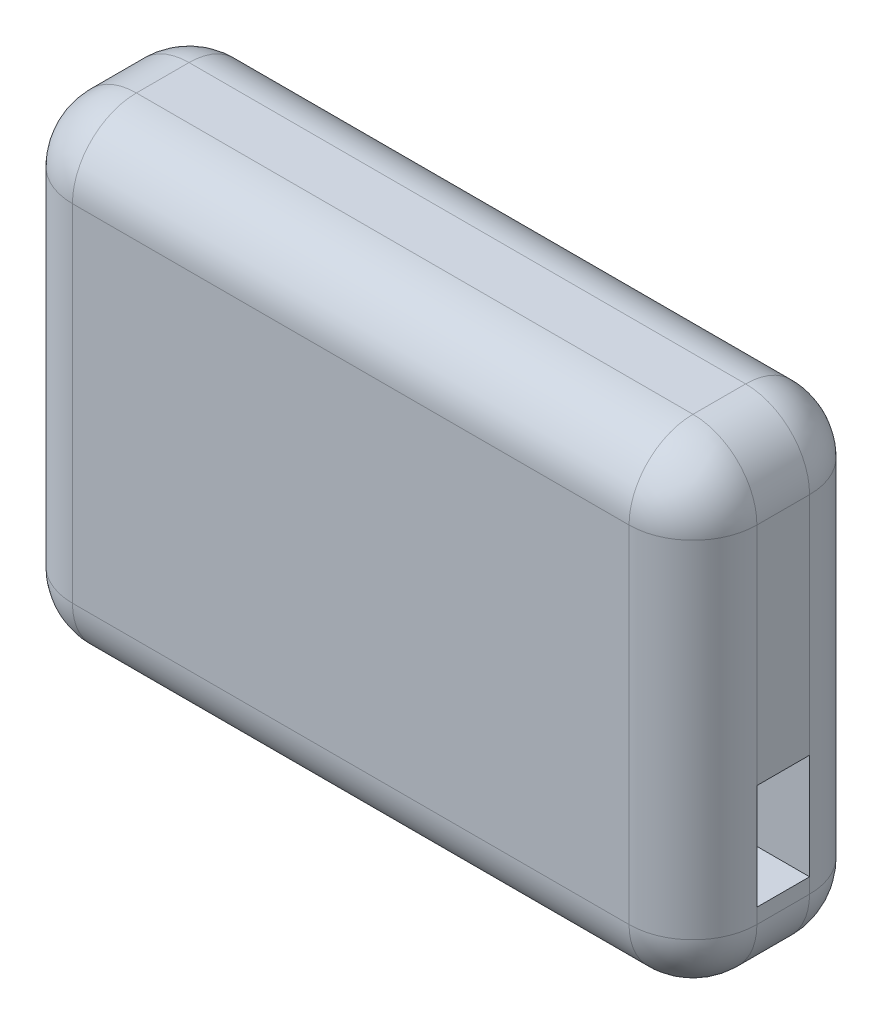
ISO-10303-21;
HEADER;
FILE_DESCRIPTION(('STEP AP214'),'2;1');
FILE_NAME('part.step','',(''),(''),'','','');
FILE_SCHEMA(('AUTOMOTIVE_DESIGN { 1 0 10303 214 1 1 1 1 }'));
ENDSEC;
DATA;
#1=APPLICATION_CONTEXT('core data for automotive mechanical design processes');
#2=APPLICATION_PROTOCOL_DEFINITION('international standard','automotive_design',2000,#1);
#3=PRODUCT_CONTEXT('',#1,'mechanical');
#4=PRODUCT('Part','Part','',(#3));
#5=PRODUCT_RELATED_PRODUCT_CATEGORY('part','',(#4));
#6=PRODUCT_DEFINITION_FORMATION('','',#4);
#7=PRODUCT_DEFINITION_CONTEXT('part definition',#1,'design');
#8=PRODUCT_DEFINITION('design','',#6,#7);
#9=PRODUCT_DEFINITION_SHAPE('','',#8);
#10=(LENGTH_UNIT() NAMED_UNIT(*) SI_UNIT(.MILLI.,.METRE.));
#11=(NAMED_UNIT(*) PLANE_ANGLE_UNIT() SI_UNIT($,.RADIAN.));
#12=(NAMED_UNIT(*) SI_UNIT($,.STERADIAN.) SOLID_ANGLE_UNIT());
#13=UNCERTAINTY_MEASURE_WITH_UNIT(LENGTH_MEASURE(1.E-05),#10,'distance_accuracy_value','');
#14=(GEOMETRIC_REPRESENTATION_CONTEXT(3) GLOBAL_UNCERTAINTY_ASSIGNED_CONTEXT((#13)) GLOBAL_UNIT_ASSIGNED_CONTEXT((#10,
#11,#12)) REPRESENTATION_CONTEXT('',''));
#15=CARTESIAN_POINT('',(0.,0.,0.));
#16=DIRECTION('',(0.,0.,1.));
#17=DIRECTION('',(1.,0.,0.));
#18=AXIS2_PLACEMENT_3D('',#15,#16,#17);
#19=CARTESIAN_POINT('',(45.5,-31.5,-12.));
#20=DIRECTION('',(1.,0.,0.));
#21=DIRECTION('',(0.,0.,-1.));
#22=AXIS2_PLACEMENT_3D('',#19,#20,#21);
#23=PLANE('',#22);
#24=DIRECTION('',(0.,0.,1.));
#25=VECTOR('',#24,1.);
#26=CARTESIAN_POINT('',(45.5,-7.,3.5));
#27=LINE('',#26,#25);
#28=CARTESIAN_POINT('',(45.5,-7.,-3.5));
#29=VERTEX_POINT('',#28);
#30=CARTESIAN_POINT('',(45.5,-7.,3.5));
#31=VERTEX_POINT('',#30);
#32=EDGE_CURVE('E60',#29,#31,#27,.T.);
#33=ORIENTED_EDGE('',*,*,#32,.F.);
#34=DIRECTION('',(0.,1.,0.));
#35=VECTOR('',#34,1.);
#36=CARTESIAN_POINT('',(45.5,-31.5,-3.5));
#37=LINE('',#36,#35);
#38=CARTESIAN_POINT('',(45.5,23.,-3.5));
#39=VERTEX_POINT('',#38);
#40=EDGE_CURVE('E258',#29,#39,#37,.T.);
#41=ORIENTED_EDGE('',*,*,#40,.T.);
#42=DIRECTION('',(0.,0.,1.));
#43=VECTOR('',#42,1.);
#44=CARTESIAN_POINT('',(45.5,23.,-12.));
#45=LINE('',#44,#43);
#46=CARTESIAN_POINT('',(45.5,23.,3.5));
#47=VERTEX_POINT('',#46);
#48=EDGE_CURVE('E338',#39,#47,#45,.T.);
#49=ORIENTED_EDGE('',*,*,#48,.T.);
#50=DIRECTION('',(0.,1.,0.));
#51=VECTOR('',#50,1.);
#52=CARTESIAN_POINT('',(45.5,-31.5,3.5));
#53=LINE('',#52,#51);
#54=EDGE_CURVE('E254',#47,#31,#53,.F.);
#55=ORIENTED_EDGE('',*,*,#54,.T.);
#56=EDGE_LOOP('',(#33,#41,#49,#55));
#57=FACE_BOUND('',#56,.T.);
#58=ADVANCED_FACE('F42',(#57),#23,.T.);
#59=DIRECTION('',(0.,0.,-1.));
#60=VECTOR('',#59,1.);
#61=CARTESIAN_POINT('',(45.5,-21.,3.5));
#62=LINE('',#61,#60);
#63=CARTESIAN_POINT('',(45.5,-21.,3.5));
#64=VERTEX_POINT('',#63);
#65=CARTESIAN_POINT('',(45.5,-21.,-3.5));
#66=VERTEX_POINT('',#65);
#67=EDGE_CURVE('E198',#64,#66,#62,.T.);
#68=ORIENTED_EDGE('',*,*,#67,.F.);
#69=CARTESIAN_POINT('',(45.5,-23.,3.5));
#70=VERTEX_POINT('',#69);
#71=EDGE_CURVE('E253',#64,#70,#53,.F.);
#72=ORIENTED_EDGE('',*,*,#71,.T.);
#73=DIRECTION('',(0.,0.,1.));
#74=VECTOR('',#73,1.);
#75=CARTESIAN_POINT('',(45.5,-23.,-12.));
#76=LINE('',#75,#74);
#77=CARTESIAN_POINT('',(45.5,-23.,-3.5));
#78=VERTEX_POINT('',#77);
#79=EDGE_CURVE('E341',#70,#78,#76,.F.);
#80=ORIENTED_EDGE('',*,*,#79,.T.);
#81=EDGE_CURVE('E259',#78,#66,#37,.T.);
#82=ORIENTED_EDGE('',*,*,#81,.T.);
#83=EDGE_LOOP('',(#68,#72,#80,#82));
#84=FACE_BOUND('',#83,.T.);
#85=ADVANCED_FACE('F437',(#84),#23,.T.);
#86=CARTESIAN_POINT('',(-45.5,-31.5,-12.));
#87=DIRECTION('',(0.,-1.,0.));
#88=DIRECTION('',(0.,0.,-1.));
#89=AXIS2_PLACEMENT_3D('',#86,#87,#88);
#90=PLANE('',#89);
#91=DIRECTION('',(1.,0.,0.));
#92=VECTOR('',#91,1.);
#93=CARTESIAN_POINT('',(-45.5,-31.5,-3.5));
#94=LINE('',#93,#92);
#95=CARTESIAN_POINT('',(-37.,-31.5,-3.5));
#96=VERTEX_POINT('',#95);
#97=CARTESIAN_POINT('',(37.,-31.5,-3.5));
#98=VERTEX_POINT('',#97);
#99=EDGE_CURVE('E249',#96,#98,#94,.T.);
#100=ORIENTED_EDGE('',*,*,#99,.T.);
#101=DIRECTION('',(0.,0.,1.));
#102=VECTOR('',#101,1.);
#103=CARTESIAN_POINT('',(37.,-31.5,-12.));
#104=LINE('',#103,#102);
#105=CARTESIAN_POINT('',(37.,-31.5,3.5));
#106=VERTEX_POINT('',#105);
#107=EDGE_CURVE('E335',#98,#106,#104,.T.);
#108=ORIENTED_EDGE('',*,*,#107,.T.);
#109=DIRECTION('',(1.,0.,0.));
#110=VECTOR('',#109,1.);
#111=CARTESIAN_POINT('',(-45.5,-31.5,3.5));
#112=LINE('',#111,#110);
#113=CARTESIAN_POINT('',(-37.,-31.5,3.5));
#114=VERTEX_POINT('',#113);
#115=EDGE_CURVE('E245',#106,#114,#112,.F.);
#116=ORIENTED_EDGE('',*,*,#115,.T.);
#117=DIRECTION('',(0.,0.,1.));
#118=VECTOR('',#117,1.);
#119=CARTESIAN_POINT('',(-37.,-31.5,-12.));
#120=LINE('',#119,#118);
#121=EDGE_CURVE('E332',#114,#96,#120,.F.);
#122=ORIENTED_EDGE('',*,*,#121,.T.);
#123=EDGE_LOOP('',(#100,#108,#116,#122));
#124=FACE_BOUND('',#123,.T.);
#125=ADVANCED_FACE('F411',(#124),#90,.T.);
#126=CARTESIAN_POINT('',(-45.5,-31.5,-12.));
#127=DIRECTION('',(-1.,0.,0.));
#128=DIRECTION('',(0.,0.,1.));
#129=AXIS2_PLACEMENT_3D('',#126,#127,#128);
#130=PLANE('',#129);
#131=DIRECTION('',(0.,-1.,0.));
#132=VECTOR('',#131,1.);
#133=CARTESIAN_POINT('',(-45.5,-31.5,-3.5));
#134=LINE('',#133,#132);
#135=CARTESIAN_POINT('',(-45.5,23.,-3.5));
#136=VERTEX_POINT('',#135);
#137=CARTESIAN_POINT('',(-45.5,-23.,-3.5));
#138=VERTEX_POINT('',#137);
#139=EDGE_CURVE('E241',#136,#138,#134,.T.);
#140=ORIENTED_EDGE('',*,*,#139,.T.);
#141=DIRECTION('',(0.,0.,1.));
#142=VECTOR('',#141,1.);
#143=CARTESIAN_POINT('',(-45.5,-23.,-12.));
#144=LINE('',#143,#142);
#145=CARTESIAN_POINT('',(-45.5,-23.,3.5));
#146=VERTEX_POINT('',#145);
#147=EDGE_CURVE('E347',#138,#146,#144,.T.);
#148=ORIENTED_EDGE('',*,*,#147,.T.);
#149=DIRECTION('',(0.,-1.,0.));
#150=VECTOR('',#149,1.);
#151=CARTESIAN_POINT('',(-45.5,31.5,3.5));
#152=LINE('',#151,#150);
#153=CARTESIAN_POINT('',(-45.5,23.,3.5));
#154=VERTEX_POINT('',#153);
#155=EDGE_CURVE('E237',#146,#154,#152,.F.);
#156=ORIENTED_EDGE('',*,*,#155,.T.);
#157=DIRECTION('',(0.,0.,1.));
#158=VECTOR('',#157,1.);
#159=CARTESIAN_POINT('',(-45.5,23.,-12.));
#160=LINE('',#159,#158);
#161=EDGE_CURVE('E344',#154,#136,#160,.F.);
#162=ORIENTED_EDGE('',*,*,#161,.T.);
#163=EDGE_LOOP('',(#140,#148,#156,#162));
#164=FACE_BOUND('',#163,.T.);
#165=ADVANCED_FACE('F426',(#164),#130,.T.);
#166=CARTESIAN_POINT('',(-45.5,31.5,-12.));
#167=DIRECTION('',(0.,1.,0.));
#168=DIRECTION('',(0.,0.,1.));
#169=AXIS2_PLACEMENT_3D('',#166,#167,#168);
#170=PLANE('',#169);
#171=DIRECTION('',(-1.,0.,0.));
#172=VECTOR('',#171,1.);
#173=CARTESIAN_POINT('',(45.5,31.5,3.5));
#174=LINE('',#173,#172);
#175=CARTESIAN_POINT('',(-37.,31.5,3.5));
#176=VERTEX_POINT('',#175);
#177=CARTESIAN_POINT('',(37.,31.5,3.5));
#178=VERTEX_POINT('',#177);
#179=EDGE_CURVE('E213',#176,#178,#174,.F.);
#180=ORIENTED_EDGE('',*,*,#179,.T.);
#181=DIRECTION('',(0.,0.,1.));
#182=VECTOR('',#181,1.);
#183=CARTESIAN_POINT('',(37.,31.5,-12.));
#184=LINE('',#183,#182);
#185=CARTESIAN_POINT('',(37.,31.5,-3.5));
#186=VERTEX_POINT('',#185);
#187=EDGE_CURVE('E11',#178,#186,#184,.F.);
#188=ORIENTED_EDGE('',*,*,#187,.T.);
#189=DIRECTION('',(-1.,0.,0.));
#190=VECTOR('',#189,1.);
#191=CARTESIAN_POINT('',(-45.5,31.5,-3.5));
#192=LINE('',#191,#190);
#193=CARTESIAN_POINT('',(-37.,31.5,-3.5));
#194=VERTEX_POINT('',#193);
#195=EDGE_CURVE('E216',#186,#194,#192,.T.);
#196=ORIENTED_EDGE('',*,*,#195,.T.);
#197=DIRECTION('',(0.,0.,1.));
#198=VECTOR('',#197,1.);
#199=CARTESIAN_POINT('',(-37.,31.5,-12.));
#200=LINE('',#199,#198);
#201=EDGE_CURVE('E52',#194,#176,#200,.T.);
#202=ORIENTED_EDGE('',*,*,#201,.T.);
#203=EDGE_LOOP('',(#180,#188,#196,#202));
#204=FACE_BOUND('',#203,.T.);
#205=ADVANCED_FACE('F428',(#204),#170,.T.);
#206=CARTESIAN_POINT('',(0.,0.,-12.));
#207=DIRECTION('',(0.,0.,-1.));
#208=DIRECTION('',(-1.,0.,0.));
#209=AXIS2_PLACEMENT_3D('',#206,#207,#208);
#210=PLANE('',#209);
#211=DIRECTION('',(0.,-1.,0.));
#212=VECTOR('',#211,1.);
#213=CARTESIAN_POINT('',(-37.,0.,-12.));
#214=LINE('',#213,#212);
#215=CARTESIAN_POINT('',(-37.,-23.,-12.));
#216=VERTEX_POINT('',#215);
#217=CARTESIAN_POINT('',(-37.,23.,-12.));
#218=VERTEX_POINT('',#217);
#219=EDGE_CURVE('E229',#216,#218,#214,.F.);
#220=ORIENTED_EDGE('',*,*,#219,.T.);
#221=DIRECTION('',(-1.,0.,0.));
#222=VECTOR('',#221,1.);
#223=CARTESIAN_POINT('',(0.,23.,-12.));
#224=LINE('',#223,#222);
#225=CARTESIAN_POINT('',(37.,23.,-12.));
#226=VERTEX_POINT('',#225);
#227=EDGE_CURVE('E233',#218,#226,#224,.F.);
#228=ORIENTED_EDGE('',*,*,#227,.T.);
#229=DIRECTION('',(0.,1.,0.));
#230=VECTOR('',#229,1.);
#231=CARTESIAN_POINT('',(37.,0.,-12.));
#232=LINE('',#231,#230);
#233=CARTESIAN_POINT('',(37.,-23.,-12.));
#234=VERTEX_POINT('',#233);
#235=EDGE_CURVE('E221',#226,#234,#232,.F.);
#236=ORIENTED_EDGE('',*,*,#235,.T.);
#237=DIRECTION('',(1.,0.,0.));
#238=VECTOR('',#237,1.);
#239=CARTESIAN_POINT('',(0.,-23.,-12.));
#240=LINE('',#239,#238);
#241=EDGE_CURVE('E225',#234,#216,#240,.F.);
#242=ORIENTED_EDGE('',*,*,#241,.T.);
#243=EDGE_LOOP('',(#220,#228,#236,#242));
#244=FACE_BOUND('',#243,.T.);
#245=ADVANCED_FACE('F434',(#244),#210,.T.);
#246=CARTESIAN_POINT('',(0.,0.,12.));
#247=DIRECTION('',(0.,0.,-1.));
#248=DIRECTION('',(-1.,0.,0.));
#249=AXIS2_PLACEMENT_3D('',#246,#247,#248);
#250=PLANE('',#249);
#251=DIRECTION('',(0.,-1.,0.));
#252=VECTOR('',#251,1.);
#253=CARTESIAN_POINT('',(-37.,-31.5,12.));
#254=LINE('',#253,#252);
#255=CARTESIAN_POINT('',(-37.,23.,12.));
#256=VERTEX_POINT('',#255);
#257=CARTESIAN_POINT('',(-37.,-23.,12.));
#258=VERTEX_POINT('',#257);
#259=EDGE_CURVE('E271',#256,#258,#254,.T.);
#260=ORIENTED_EDGE('',*,*,#259,.T.);
#261=DIRECTION('',(1.,0.,0.));
#262=VECTOR('',#261,1.);
#263=CARTESIAN_POINT('',(45.5,-23.,12.));
#264=LINE('',#263,#262);
#265=CARTESIAN_POINT('',(37.,-23.,12.));
#266=VERTEX_POINT('',#265);
#267=EDGE_CURVE('E275',#258,#266,#264,.T.);
#268=ORIENTED_EDGE('',*,*,#267,.T.);
#269=DIRECTION('',(0.,1.,0.));
#270=VECTOR('',#269,1.);
#271=CARTESIAN_POINT('',(37.,31.5,12.));
#272=LINE('',#271,#270);
#273=CARTESIAN_POINT('',(37.,23.,12.));
#274=VERTEX_POINT('',#273);
#275=EDGE_CURVE('E263',#266,#274,#272,.T.);
#276=ORIENTED_EDGE('',*,*,#275,.T.);
#277=DIRECTION('',(-1.,0.,0.));
#278=VECTOR('',#277,1.);
#279=CARTESIAN_POINT('',(-45.5,23.,12.));
#280=LINE('',#279,#278);
#281=EDGE_CURVE('E267',#274,#256,#280,.T.);
#282=ORIENTED_EDGE('',*,*,#281,.T.);
#283=EDGE_LOOP('',(#260,#268,#276,#282));
#284=FACE_BOUND('',#283,.T.);
#285=ADVANCED_FACE('F393',(#284),#250,.F.);
#286=CARTESIAN_POINT('',(-45.5,-23.,-3.5));
#287=DIRECTION('',(1.,0.,0.));
#288=DIRECTION('',(0.,0.,-1.));
#289=AXIS2_PLACEMENT_3D('',#286,#287,#288);
#290=CYLINDRICAL_SURFACE('',#289,8.5);
#291=ORIENTED_EDGE('',*,*,#241,.F.);
#292=CARTESIAN_POINT('',(37.,-23.,-3.5));
#293=DIRECTION('',(1.,0.,0.));
#294=DIRECTION('',(0.,0.,-1.));
#295=AXIS2_PLACEMENT_3D('',#292,#293,#294);
#296=CIRCLE('',#295,8.5);
#297=EDGE_CURVE('E290',#234,#98,#296,.F.);
#298=ORIENTED_EDGE('',*,*,#297,.T.);
#299=ORIENTED_EDGE('',*,*,#99,.F.);
#300=CARTESIAN_POINT('',(-37.,-23.,-3.5));
#301=DIRECTION('',(1.,0.,0.));
#302=DIRECTION('',(0.,0.,-1.));
#303=AXIS2_PLACEMENT_3D('',#300,#301,#302);
#304=CIRCLE('',#303,8.5);
#305=EDGE_CURVE('E287',#96,#216,#304,.T.);
#306=ORIENTED_EDGE('',*,*,#305,.T.);
#307=EDGE_LOOP('',(#291,#298,#299,#306));
#308=FACE_BOUND('',#307,.T.);
#309=ADVANCED_FACE('F417',(#308),#290,.T.);
#310=CARTESIAN_POINT('',(37.,-31.5,-3.5));
#311=DIRECTION('',(0.,1.,0.));
#312=DIRECTION('',(0.,0.,1.));
#313=AXIS2_PLACEMENT_3D('',#310,#311,#312);
#314=CYLINDRICAL_SURFACE('',#313,8.5);
#315=ORIENTED_EDGE('',*,*,#81,.F.);
#316=CARTESIAN_POINT('',(37.,-23.,-3.5));
#317=DIRECTION('',(0.,1.,0.));
#318=DIRECTION('',(0.,0.,1.));
#319=AXIS2_PLACEMENT_3D('',#316,#317,#318);
#320=CIRCLE('',#319,8.5);
#321=EDGE_CURVE('E283',#78,#234,#320,.T.);
#322=ORIENTED_EDGE('',*,*,#321,.T.);
#323=ORIENTED_EDGE('',*,*,#235,.F.);
#324=CARTESIAN_POINT('',(37.,23.,-3.5));
#325=DIRECTION('',(0.,1.,0.));
#326=DIRECTION('',(0.,0.,1.));
#327=AXIS2_PLACEMENT_3D('',#324,#325,#326);
#328=CIRCLE('',#327,8.5);
#329=EDGE_CURVE('E279',#226,#39,#328,.F.);
#330=ORIENTED_EDGE('',*,*,#329,.T.);
#331=ORIENTED_EDGE('',*,*,#40,.F.);
#332=DIRECTION('',(0.,1.,0.));
#333=VECTOR('',#332,1.);
#334=CARTESIAN_POINT('',(45.5,-7.,-3.5));
#335=LINE('',#334,#333);
#336=EDGE_CURVE('E189',#66,#29,#335,.T.);
#337=ORIENTED_EDGE('',*,*,#336,.F.);
#338=EDGE_LOOP('',(#315,#322,#323,#330,#331,#337));
#339=FACE_BOUND('',#338,.T.);
#340=ADVANCED_FACE('F453',(#339),#314,.T.);
#341=CARTESIAN_POINT('',(-37.,-31.5,-3.5));
#342=DIRECTION('',(0.,-1.,0.));
#343=DIRECTION('',(0.,0.,-1.));
#344=AXIS2_PLACEMENT_3D('',#341,#342,#343);
#345=CYLINDRICAL_SURFACE('',#344,8.5);
#346=ORIENTED_EDGE('',*,*,#219,.F.);
#347=CARTESIAN_POINT('',(-37.,-23.,-3.5));
#348=DIRECTION('',(0.,-1.,0.));
#349=DIRECTION('',(0.,0.,-1.));
#350=AXIS2_PLACEMENT_3D('',#347,#348,#349);
#351=CIRCLE('',#350,8.5);
#352=EDGE_CURVE('E309',#216,#138,#351,.F.);
#353=ORIENTED_EDGE('',*,*,#352,.T.);
#354=ORIENTED_EDGE('',*,*,#139,.F.);
#355=CARTESIAN_POINT('',(-37.,23.,-3.5));
#356=DIRECTION('',(0.,-1.,0.));
#357=DIRECTION('',(0.,0.,-1.));
#358=AXIS2_PLACEMENT_3D('',#355,#356,#357);
#359=CIRCLE('',#358,8.5);
#360=EDGE_CURVE('E306',#136,#218,#359,.T.);
#361=ORIENTED_EDGE('',*,*,#360,.T.);
#362=EDGE_LOOP('',(#346,#353,#354,#361));
#363=FACE_BOUND('',#362,.T.);
#364=ADVANCED_FACE('F424',(#363),#345,.T.);
#365=CARTESIAN_POINT('',(-45.5,23.,-3.5));
#366=DIRECTION('',(-1.,0.,0.));
#367=DIRECTION('',(0.,0.,1.));
#368=AXIS2_PLACEMENT_3D('',#365,#366,#367);
#369=CYLINDRICAL_SURFACE('',#368,8.5);
#370=ORIENTED_EDGE('',*,*,#195,.F.);
#371=CARTESIAN_POINT('',(37.,23.,-3.5));
#372=DIRECTION('',(-1.,0.,0.));
#373=DIRECTION('',(0.,0.,1.));
#374=AXIS2_PLACEMENT_3D('',#371,#372,#373);
#375=CIRCLE('',#374,8.5);
#376=EDGE_CURVE('E323',#186,#226,#375,.T.);
#377=ORIENTED_EDGE('',*,*,#376,.T.);
#378=ORIENTED_EDGE('',*,*,#227,.F.);
#379=CARTESIAN_POINT('',(-37.,23.,-3.5));
#380=DIRECTION('',(-1.,0.,0.));
#381=DIRECTION('',(0.,0.,1.));
#382=AXIS2_PLACEMENT_3D('',#379,#380,#381);
#383=CIRCLE('',#382,8.5);
#384=EDGE_CURVE('E319',#218,#194,#383,.F.);
#385=ORIENTED_EDGE('',*,*,#384,.T.);
#386=EDGE_LOOP('',(#370,#377,#378,#385));
#387=FACE_BOUND('',#386,.T.);
#388=ADVANCED_FACE('F447',(#387),#369,.T.);
#389=CARTESIAN_POINT('',(0.,23.,3.5));
#390=DIRECTION('',(1.,0.,0.));
#391=DIRECTION('',(0.,0.,-1.));
#392=AXIS2_PLACEMENT_3D('',#389,#390,#391);
#393=CYLINDRICAL_SURFACE('',#392,8.5);
#394=ORIENTED_EDGE('',*,*,#281,.F.);
#395=CARTESIAN_POINT('',(37.,23.,3.5));
#396=DIRECTION('',(1.,0.,0.));
#397=DIRECTION('',(0.,0.,-1.));
#398=AXIS2_PLACEMENT_3D('',#395,#396,#397);
#399=CIRCLE('',#398,8.5);
#400=EDGE_CURVE('E68',#274,#178,#399,.F.);
#401=ORIENTED_EDGE('',*,*,#400,.T.);
#402=ORIENTED_EDGE('',*,*,#179,.F.);
#403=CARTESIAN_POINT('',(-37.,23.,3.5));
#404=DIRECTION('',(1.,0.,0.));
#405=DIRECTION('',(0.,0.,-1.));
#406=AXIS2_PLACEMENT_3D('',#403,#404,#405);
#407=CIRCLE('',#406,8.5);
#408=EDGE_CURVE('E327',#176,#256,#407,.T.);
#409=ORIENTED_EDGE('',*,*,#408,.T.);
#410=EDGE_LOOP('',(#394,#401,#402,#409));
#411=FACE_BOUND('',#410,.T.);
#412=ADVANCED_FACE('F390',(#411),#393,.T.);
#413=CARTESIAN_POINT('',(-37.,0.,3.5));
#414=DIRECTION('',(0.,1.,0.));
#415=DIRECTION('',(0.,0.,1.));
#416=AXIS2_PLACEMENT_3D('',#413,#414,#415);
#417=CYLINDRICAL_SURFACE('',#416,8.5);
#418=ORIENTED_EDGE('',*,*,#155,.F.);
#419=CARTESIAN_POINT('',(-37.,-23.,3.5));
#420=DIRECTION('',(0.,1.,0.));
#421=DIRECTION('',(0.,0.,1.));
#422=AXIS2_PLACEMENT_3D('',#419,#420,#421);
#423=CIRCLE('',#422,8.5);
#424=EDGE_CURVE('E316',#146,#258,#423,.T.);
#425=ORIENTED_EDGE('',*,*,#424,.T.);
#426=ORIENTED_EDGE('',*,*,#259,.F.);
#427=CARTESIAN_POINT('',(-37.,23.,3.5));
#428=DIRECTION('',(0.,1.,0.));
#429=DIRECTION('',(0.,0.,1.));
#430=AXIS2_PLACEMENT_3D('',#427,#428,#429);
#431=CIRCLE('',#430,8.5);
#432=EDGE_CURVE('E313',#256,#154,#431,.F.);
#433=ORIENTED_EDGE('',*,*,#432,.T.);
#434=EDGE_LOOP('',(#418,#425,#426,#433));
#435=FACE_BOUND('',#434,.T.);
#436=ADVANCED_FACE('F398',(#435),#417,.T.);
#437=CARTESIAN_POINT('',(37.,0.,3.5));
#438=DIRECTION('',(0.,-1.,0.));
#439=DIRECTION('',(0.,0.,-1.));
#440=AXIS2_PLACEMENT_3D('',#437,#438,#439);
#441=CYLINDRICAL_SURFACE('',#440,8.5);
#442=ORIENTED_EDGE('',*,*,#275,.F.);
#443=CARTESIAN_POINT('',(37.,-23.,3.5));
#444=DIRECTION('',(0.,-1.,0.));
#445=DIRECTION('',(0.,0.,-1.));
#446=AXIS2_PLACEMENT_3D('',#443,#444,#445);
#447=CIRCLE('',#446,8.5);
#448=EDGE_CURVE('E302',#266,#70,#447,.F.);
#449=ORIENTED_EDGE('',*,*,#448,.T.);
#450=ORIENTED_EDGE('',*,*,#71,.F.);
#451=DIRECTION('',(0.,-1.,0.));
#452=VECTOR('',#451,1.);
#453=CARTESIAN_POINT('',(45.5,-7.,3.5));
#454=LINE('',#453,#452);
#455=EDGE_CURVE('E166',#31,#64,#454,.T.);
#456=ORIENTED_EDGE('',*,*,#455,.F.);
#457=ORIENTED_EDGE('',*,*,#54,.F.);
#458=CARTESIAN_POINT('',(37.,23.,3.5));
#459=DIRECTION('',(0.,-1.,0.));
#460=DIRECTION('',(0.,0.,-1.));
#461=AXIS2_PLACEMENT_3D('',#458,#459,#460);
#462=CIRCLE('',#461,8.5);
#463=EDGE_CURVE('E299',#47,#274,#462,.T.);
#464=ORIENTED_EDGE('',*,*,#463,.T.);
#465=EDGE_LOOP('',(#442,#449,#450,#456,#457,#464));
#466=FACE_BOUND('',#465,.T.);
#467=ADVANCED_FACE('F463',(#466),#441,.T.);
#468=CARTESIAN_POINT('',(0.,-23.,3.5));
#469=DIRECTION('',(-1.,0.,0.));
#470=DIRECTION('',(0.,0.,1.));
#471=AXIS2_PLACEMENT_3D('',#468,#469,#470);
#472=CYLINDRICAL_SURFACE('',#471,8.5);
#473=ORIENTED_EDGE('',*,*,#115,.F.);
#474=CARTESIAN_POINT('',(37.,-23.,3.5));
#475=DIRECTION('',(-1.,0.,0.));
#476=DIRECTION('',(0.,0.,1.));
#477=AXIS2_PLACEMENT_3D('',#474,#475,#476);
#478=CIRCLE('',#477,8.5);
#479=EDGE_CURVE('E296',#106,#266,#478,.T.);
#480=ORIENTED_EDGE('',*,*,#479,.T.);
#481=ORIENTED_EDGE('',*,*,#267,.F.);
#482=CARTESIAN_POINT('',(-37.,-23.,3.5));
#483=DIRECTION('',(-1.,0.,0.));
#484=DIRECTION('',(0.,0.,1.));
#485=AXIS2_PLACEMENT_3D('',#482,#483,#484);
#486=CIRCLE('',#485,8.5);
#487=EDGE_CURVE('E293',#258,#114,#486,.F.);
#488=ORIENTED_EDGE('',*,*,#487,.T.);
#489=EDGE_LOOP('',(#473,#480,#481,#488));
#490=FACE_BOUND('',#489,.T.);
#491=ADVANCED_FACE('F459',(#490),#472,.T.);
#492=CARTESIAN_POINT('',(37.,-23.,3.5));
#493=DIRECTION('',(0.,0.,1.));
#494=DIRECTION('',(1.,0.,0.));
#495=AXIS2_PLACEMENT_3D('',#492,#493,#494);
#496=SPHERICAL_SURFACE('',#495,8.5);
#497=ORIENTED_EDGE('',*,*,#448,.F.);
#498=ORIENTED_EDGE('',*,*,#479,.F.);
#499=CARTESIAN_POINT('',(37.,-23.,3.5));
#500=DIRECTION('',(0.,0.,-1.));
#501=DIRECTION('',(-1.,0.,0.));
#502=AXIS2_PLACEMENT_3D('',#499,#500,#501);
#503=CIRCLE('',#502,8.5);
#504=EDGE_CURVE('E217',#70,#106,#503,.T.);
#505=ORIENTED_EDGE('',*,*,#504,.F.);
#506=EDGE_LOOP('',(#497,#498,#505));
#507=FACE_BOUND('',#506,.T.);
#508=ADVANCED_FACE('F462',(#507),#496,.T.);
#509=CARTESIAN_POINT('',(37.,-23.,-12.));
#510=DIRECTION('',(0.,0.,1.));
#511=DIRECTION('',(1.,0.,0.));
#512=AXIS2_PLACEMENT_3D('',#509,#510,#511);
#513=CYLINDRICAL_SURFACE('',#512,8.5);
#514=ORIENTED_EDGE('',*,*,#504,.T.);
#515=ORIENTED_EDGE('',*,*,#107,.F.);
#516=CARTESIAN_POINT('',(37.,-23.,-3.5));
#517=DIRECTION('',(0.,0.,-1.));
#518=DIRECTION('',(-1.,0.,0.));
#519=AXIS2_PLACEMENT_3D('',#516,#517,#518);
#520=CIRCLE('',#519,8.5);
#521=EDGE_CURVE('E352',#78,#98,#520,.T.);
#522=ORIENTED_EDGE('',*,*,#521,.F.);
#523=ORIENTED_EDGE('',*,*,#79,.F.);
#524=EDGE_LOOP('',(#514,#515,#522,#523));
#525=FACE_BOUND('',#524,.T.);
#526=ADVANCED_FACE('F475',(#525),#513,.T.);
#527=CARTESIAN_POINT('',(37.,-23.,-3.5));
#528=DIRECTION('',(0.,0.,1.));
#529=DIRECTION('',(1.,0.,0.));
#530=AXIS2_PLACEMENT_3D('',#527,#528,#529);
#531=SPHERICAL_SURFACE('',#530,8.5);
#532=ORIENTED_EDGE('',*,*,#521,.T.);
#533=ORIENTED_EDGE('',*,*,#297,.F.);
#534=ORIENTED_EDGE('',*,*,#321,.F.);
#535=EDGE_LOOP('',(#532,#533,#534));
#536=FACE_BOUND('',#535,.T.);
#537=ADVANCED_FACE('F472',(#536),#531,.T.);
#538=CARTESIAN_POINT('',(-37.,-23.,3.5));
#539=DIRECTION('',(0.,0.,1.));
#540=DIRECTION('',(1.,0.,0.));
#541=AXIS2_PLACEMENT_3D('',#538,#539,#540);
#542=SPHERICAL_SURFACE('',#541,8.5);
#543=ORIENTED_EDGE('',*,*,#487,.F.);
#544=ORIENTED_EDGE('',*,*,#424,.F.);
#545=CARTESIAN_POINT('',(-37.,-23.,3.5));
#546=DIRECTION('',(0.,0.,-1.));
#547=DIRECTION('',(-1.,0.,0.));
#548=AXIS2_PLACEMENT_3D('',#545,#546,#547);
#549=CIRCLE('',#548,8.5);
#550=EDGE_CURVE('E356',#114,#146,#549,.T.);
#551=ORIENTED_EDGE('',*,*,#550,.F.);
#552=EDGE_LOOP('',(#543,#544,#551));
#553=FACE_BOUND('',#552,.T.);
#554=ADVANCED_FACE('F403',(#553),#542,.T.);
#555=CARTESIAN_POINT('',(-37.,-23.,-12.));
#556=DIRECTION('',(0.,0.,1.));
#557=DIRECTION('',(1.,0.,0.));
#558=AXIS2_PLACEMENT_3D('',#555,#556,#557);
#559=CYLINDRICAL_SURFACE('',#558,8.5);
#560=ORIENTED_EDGE('',*,*,#550,.T.);
#561=ORIENTED_EDGE('',*,*,#147,.F.);
#562=CARTESIAN_POINT('',(-37.,-23.,-3.5));
#563=DIRECTION('',(0.,0.,-1.));
#564=DIRECTION('',(-1.,0.,0.));
#565=AXIS2_PLACEMENT_3D('',#562,#563,#564);
#566=CIRCLE('',#565,8.5);
#567=EDGE_CURVE('E360',#96,#138,#566,.T.);
#568=ORIENTED_EDGE('',*,*,#567,.F.);
#569=ORIENTED_EDGE('',*,*,#121,.F.);
#570=EDGE_LOOP('',(#560,#561,#568,#569));
#571=FACE_BOUND('',#570,.T.);
#572=ADVANCED_FACE('F407',(#571),#559,.T.);
#573=CARTESIAN_POINT('',(-37.,-23.,-3.5));
#574=DIRECTION('',(0.,0.,1.));
#575=DIRECTION('',(1.,0.,0.));
#576=AXIS2_PLACEMENT_3D('',#573,#574,#575);
#577=SPHERICAL_SURFACE('',#576,8.5);
#578=ORIENTED_EDGE('',*,*,#352,.F.);
#579=ORIENTED_EDGE('',*,*,#305,.F.);
#580=ORIENTED_EDGE('',*,*,#567,.T.);
#581=EDGE_LOOP('',(#578,#579,#580));
#582=FACE_BOUND('',#581,.T.);
#583=ADVANCED_FACE('F420',(#582),#577,.T.);
#584=CARTESIAN_POINT('',(37.,23.,3.5));
#585=DIRECTION('',(0.,0.,1.));
#586=DIRECTION('',(1.,0.,0.));
#587=AXIS2_PLACEMENT_3D('',#584,#585,#586);
#588=SPHERICAL_SURFACE('',#587,8.5);
#589=ORIENTED_EDGE('',*,*,#400,.F.);
#590=ORIENTED_EDGE('',*,*,#463,.F.);
#591=CARTESIAN_POINT('',(37.,23.,3.5));
#592=DIRECTION('',(0.,0.,-1.));
#593=DIRECTION('',(-1.,0.,0.));
#594=AXIS2_PLACEMENT_3D('',#591,#592,#593);
#595=CIRCLE('',#594,8.5);
#596=EDGE_CURVE('E363',#178,#47,#595,.T.);
#597=ORIENTED_EDGE('',*,*,#596,.F.);
#598=EDGE_LOOP('',(#589,#590,#597));
#599=FACE_BOUND('',#598,.T.);
#600=ADVANCED_FACE('F485',(#599),#588,.T.);
#601=CARTESIAN_POINT('',(37.,23.,-12.));
#602=DIRECTION('',(0.,0.,1.));
#603=DIRECTION('',(1.,0.,0.));
#604=AXIS2_PLACEMENT_3D('',#601,#602,#603);
#605=CYLINDRICAL_SURFACE('',#604,8.5);
#606=ORIENTED_EDGE('',*,*,#596,.T.);
#607=ORIENTED_EDGE('',*,*,#48,.F.);
#608=CARTESIAN_POINT('',(37.,23.,-3.5));
#609=DIRECTION('',(0.,0.,-1.));
#610=DIRECTION('',(-1.,0.,0.));
#611=AXIS2_PLACEMENT_3D('',#608,#609,#610);
#612=CIRCLE('',#611,8.5);
#613=EDGE_CURVE('E367',#186,#39,#612,.T.);
#614=ORIENTED_EDGE('',*,*,#613,.F.);
#615=ORIENTED_EDGE('',*,*,#187,.F.);
#616=EDGE_LOOP('',(#606,#607,#614,#615));
#617=FACE_BOUND('',#616,.T.);
#618=ADVANCED_FACE('F493',(#617),#605,.T.);
#619=CARTESIAN_POINT('',(37.,23.,-3.5));
#620=DIRECTION('',(0.,0.,1.));
#621=DIRECTION('',(1.,0.,0.));
#622=AXIS2_PLACEMENT_3D('',#619,#620,#621);
#623=SPHERICAL_SURFACE('',#622,8.5);
#624=ORIENTED_EDGE('',*,*,#613,.T.);
#625=ORIENTED_EDGE('',*,*,#329,.F.);
#626=ORIENTED_EDGE('',*,*,#376,.F.);
#627=EDGE_LOOP('',(#624,#625,#626));
#628=FACE_BOUND('',#627,.T.);
#629=ADVANCED_FACE('F490',(#628),#623,.T.);
#630=CARTESIAN_POINT('',(-37.,23.,3.5));
#631=DIRECTION('',(0.,0.,1.));
#632=DIRECTION('',(1.,0.,0.));
#633=AXIS2_PLACEMENT_3D('',#630,#631,#632);
#634=SPHERICAL_SURFACE('',#633,8.5);
#635=ORIENTED_EDGE('',*,*,#432,.F.);
#636=ORIENTED_EDGE('',*,*,#408,.F.);
#637=CARTESIAN_POINT('',(-37.,23.,3.5));
#638=DIRECTION('',(0.,0.,-1.));
#639=DIRECTION('',(-1.,0.,0.));
#640=AXIS2_PLACEMENT_3D('',#637,#638,#639);
#641=CIRCLE('',#640,8.5);
#642=EDGE_CURVE('E46',#154,#176,#641,.T.);
#643=ORIENTED_EDGE('',*,*,#642,.F.);
#644=EDGE_LOOP('',(#635,#636,#643));
#645=FACE_BOUND('',#644,.T.);
#646=ADVANCED_FACE('F44',(#645),#634,.T.);
#647=CARTESIAN_POINT('',(-37.,23.,-12.));
#648=DIRECTION('',(0.,0.,1.));
#649=DIRECTION('',(1.,0.,0.));
#650=AXIS2_PLACEMENT_3D('',#647,#648,#649);
#651=CYLINDRICAL_SURFACE('',#650,8.5);
#652=ORIENTED_EDGE('',*,*,#642,.T.);
#653=ORIENTED_EDGE('',*,*,#201,.F.);
#654=CARTESIAN_POINT('',(-37.,23.,-3.5));
#655=DIRECTION('',(0.,0.,-1.));
#656=DIRECTION('',(-1.,0.,0.));
#657=AXIS2_PLACEMENT_3D('',#654,#655,#656);
#658=CIRCLE('',#657,8.5);
#659=EDGE_CURVE('E207',#136,#194,#658,.T.);
#660=ORIENTED_EDGE('',*,*,#659,.F.);
#661=ORIENTED_EDGE('',*,*,#161,.F.);
#662=EDGE_LOOP('',(#652,#653,#660,#661));
#663=FACE_BOUND('',#662,.T.);
#664=ADVANCED_FACE('F386',(#663),#651,.T.);
#665=CARTESIAN_POINT('',(-37.,23.,-3.5));
#666=DIRECTION('',(0.,0.,1.));
#667=DIRECTION('',(1.,0.,0.));
#668=AXIS2_PLACEMENT_3D('',#665,#666,#667);
#669=SPHERICAL_SURFACE('',#668,8.5);
#670=ORIENTED_EDGE('',*,*,#384,.F.);
#671=ORIENTED_EDGE('',*,*,#360,.F.);
#672=ORIENTED_EDGE('',*,*,#659,.T.);
#673=EDGE_LOOP('',(#670,#671,#672));
#674=FACE_BOUND('',#673,.T.);
#675=ADVANCED_FACE('F501',(#674),#669,.T.);
#676=CARTESIAN_POINT('',(33.5,-7.,3.5));
#677=DIRECTION('',(0.,0.,1.));
#678=DIRECTION('',(0.,-1.,0.));
#679=AXIS2_PLACEMENT_3D('',#676,#677,#678);
#680=PLANE('',#679);
#681=ORIENTED_EDGE('',*,*,#455,.T.);
#682=DIRECTION('',(1.,0.,0.));
#683=VECTOR('',#682,1.);
#684=CARTESIAN_POINT('',(33.5,-21.,3.5));
#685=LINE('',#684,#683);
#686=CARTESIAN_POINT('',(33.5,-21.,3.5));
#687=VERTEX_POINT('',#686);
#688=EDGE_CURVE('E159',#687,#64,#685,.T.);
#689=ORIENTED_EDGE('',*,*,#688,.F.);
#690=DIRECTION('',(0.,-1.,0.));
#691=VECTOR('',#690,1.);
#692=CARTESIAN_POINT('',(33.5,-7.,3.5));
#693=LINE('',#692,#691);
#694=CARTESIAN_POINT('',(33.5,-7.,3.5));
#695=VERTEX_POINT('',#694);
#696=EDGE_CURVE('E163',#695,#687,#693,.T.);
#697=ORIENTED_EDGE('',*,*,#696,.F.);
#698=DIRECTION('',(1.,0.,0.));
#699=VECTOR('',#698,1.);
#700=CARTESIAN_POINT('',(33.5,-7.,3.5));
#701=LINE('',#700,#699);
#702=EDGE_CURVE('E204',#695,#31,#701,.T.);
#703=ORIENTED_EDGE('',*,*,#702,.T.);
#704=EDGE_LOOP('',(#681,#689,#697,#703));
#705=FACE_BOUND('',#704,.T.);
#706=ADVANCED_FACE('F161',(#705),#680,.F.);
#707=CARTESIAN_POINT('',(33.5,-7.,3.5));
#708=DIRECTION('',(0.,1.,0.));
#709=DIRECTION('',(0.,0.,1.));
#710=AXIS2_PLACEMENT_3D('',#707,#708,#709);
#711=PLANE('',#710);
#712=ORIENTED_EDGE('',*,*,#32,.T.);
#713=ORIENTED_EDGE('',*,*,#702,.F.);
#714=DIRECTION('',(0.,0.,1.));
#715=VECTOR('',#714,1.);
#716=CARTESIAN_POINT('',(33.5,-7.,3.5));
#717=LINE('',#716,#715);
#718=CARTESIAN_POINT('',(33.5,-7.,-3.5));
#719=VERTEX_POINT('',#718);
#720=EDGE_CURVE('E172',#719,#695,#717,.T.);
#721=ORIENTED_EDGE('',*,*,#720,.F.);
#722=DIRECTION('',(1.,0.,0.));
#723=VECTOR('',#722,1.);
#724=CARTESIAN_POINT('',(33.5,-7.,-3.5));
#725=LINE('',#724,#723);
#726=EDGE_CURVE('E208',#719,#29,#725,.T.);
#727=ORIENTED_EDGE('',*,*,#726,.T.);
#728=EDGE_LOOP('',(#712,#713,#721,#727));
#729=FACE_BOUND('',#728,.T.);
#730=ADVANCED_FACE('F735',(#729),#711,.F.);
#731=CARTESIAN_POINT('',(33.5,-7.,-3.5));
#732=DIRECTION('',(0.,0.,-1.));
#733=DIRECTION('',(-1.,0.,0.));
#734=AXIS2_PLACEMENT_3D('',#731,#732,#733);
#735=PLANE('',#734);
#736=ORIENTED_EDGE('',*,*,#336,.T.);
#737=ORIENTED_EDGE('',*,*,#726,.F.);
#738=DIRECTION('',(0.,1.,0.));
#739=VECTOR('',#738,1.);
#740=CARTESIAN_POINT('',(33.5,-7.,-3.5));
#741=LINE('',#740,#739);
#742=CARTESIAN_POINT('',(33.5,-21.,-3.5));
#743=VERTEX_POINT('',#742);
#744=EDGE_CURVE('E181',#743,#719,#741,.T.);
#745=ORIENTED_EDGE('',*,*,#744,.F.);
#746=DIRECTION('',(1.,0.,0.));
#747=VECTOR('',#746,1.);
#748=CARTESIAN_POINT('',(33.5,-21.,-3.5));
#749=LINE('',#748,#747);
#750=EDGE_CURVE('E171',#743,#66,#749,.T.);
#751=ORIENTED_EDGE('',*,*,#750,.T.);
#752=EDGE_LOOP('',(#736,#737,#745,#751));
#753=FACE_BOUND('',#752,.T.);
#754=ADVANCED_FACE('F745',(#753),#735,.F.);
#755=CARTESIAN_POINT('',(33.5,-21.,3.5));
#756=DIRECTION('',(0.,-1.,0.));
#757=DIRECTION('',(0.,0.,-1.));
#758=AXIS2_PLACEMENT_3D('',#755,#756,#757);
#759=PLANE('',#758);
#760=ORIENTED_EDGE('',*,*,#67,.T.);
#761=ORIENTED_EDGE('',*,*,#750,.F.);
#762=DIRECTION('',(0.,0.,-1.));
#763=VECTOR('',#762,1.);
#764=CARTESIAN_POINT('',(33.5,-21.,3.5));
#765=LINE('',#764,#763);
#766=EDGE_CURVE('E175',#687,#743,#765,.T.);
#767=ORIENTED_EDGE('',*,*,#766,.F.);
#768=ORIENTED_EDGE('',*,*,#688,.T.);
#769=EDGE_LOOP('',(#760,#761,#767,#768));
#770=FACE_BOUND('',#769,.T.);
#771=ADVANCED_FACE('F176',(#770),#759,.F.);
#772=CARTESIAN_POINT('',(33.5,0.,0.));
#773=DIRECTION('',(1.,0.,0.));
#774=DIRECTION('',(0.,0.,-1.));
#775=AXIS2_PLACEMENT_3D('',#772,#773,#774);
#776=PLANE('',#775);
#777=ORIENTED_EDGE('',*,*,#696,.T.);
#778=ORIENTED_EDGE('',*,*,#766,.T.);
#779=ORIENTED_EDGE('',*,*,#744,.T.);
#780=ORIENTED_EDGE('',*,*,#720,.T.);
#781=EDGE_LOOP('',(#777,#778,#779,#780));
#782=FACE_BOUND('',#781,.T.);
#783=ADVANCED_FACE('F183',(#782),#776,.T.);
#784=CLOSED_SHELL('',(#58,#85,#125,#165,#205,#245,#285,#309,#340,#364,#388,#412,#436,#467,#491,
#508,#526,#537,#554,#572,#583,#600,#618,#629,#646,#664,#675,#706,#730,#754,#771,#783));
#785=MANIFOLD_SOLID_BREP('B2',#784);
#786=ADVANCED_BREP_SHAPE_REPRESENTATION('',(#18,#785),#14);
#787=SHAPE_DEFINITION_REPRESENTATION(#9,#786);
ENDSEC;
END-ISO-10303-21;
